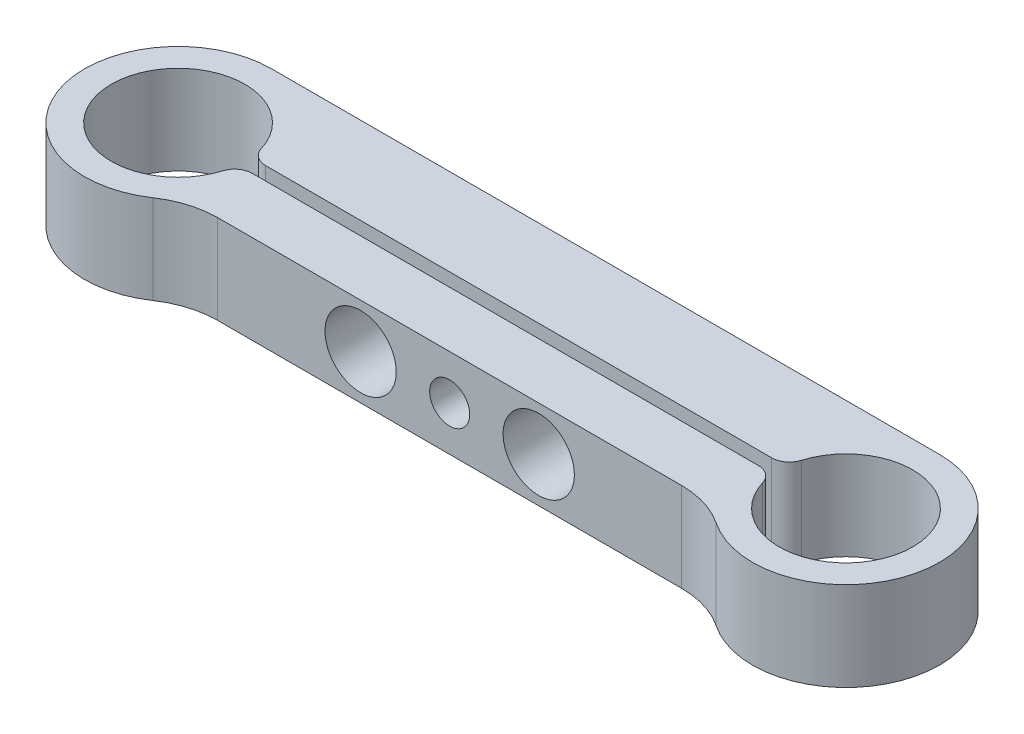
ISO-10303-21;
HEADER;
FILE_DESCRIPTION(('STEP AP214'),'2;1');
FILE_NAME('part.step','',(''),(''),'','','');
FILE_SCHEMA(('AUTOMOTIVE_DESIGN { 1 0 10303 214 1 1 1 1 }'));
ENDSEC;
DATA;
#1=APPLICATION_CONTEXT('core data for automotive mechanical design processes');
#2=APPLICATION_PROTOCOL_DEFINITION('international standard','automotive_design',2000,#1);
#3=PRODUCT_CONTEXT('',#1,'mechanical');
#4=PRODUCT('Part','Part','',(#3));
#5=PRODUCT_RELATED_PRODUCT_CATEGORY('part','',(#4));
#6=PRODUCT_DEFINITION_FORMATION('','',#4);
#7=PRODUCT_DEFINITION_CONTEXT('part definition',#1,'design');
#8=PRODUCT_DEFINITION('design','',#6,#7);
#9=PRODUCT_DEFINITION_SHAPE('','',#8);
#10=(LENGTH_UNIT() NAMED_UNIT(*) SI_UNIT(.MILLI.,.METRE.));
#11=(NAMED_UNIT(*) PLANE_ANGLE_UNIT() SI_UNIT($,.RADIAN.));
#12=(NAMED_UNIT(*) SI_UNIT($,.STERADIAN.) SOLID_ANGLE_UNIT());
#13=UNCERTAINTY_MEASURE_WITH_UNIT(LENGTH_MEASURE(1.E-05),#10,'distance_accuracy_value','');
#14=(GEOMETRIC_REPRESENTATION_CONTEXT(3) GLOBAL_UNCERTAINTY_ASSIGNED_CONTEXT((#13)) GLOBAL_UNIT_ASSIGNED_CONTEXT((#10,
#11,#12)) REPRESENTATION_CONTEXT('',''));
#15=CARTESIAN_POINT('',(0.,0.,0.));
#16=DIRECTION('',(0.,0.,1.));
#17=DIRECTION('',(1.,0.,0.));
#18=AXIS2_PLACEMENT_3D('',#15,#16,#17);
#19=CARTESIAN_POINT('',(75.,10.,0.));
#20=DIRECTION('',(0.,1.,0.));
#21=DIRECTION('',(0.,0.,1.));
#22=AXIS2_PLACEMENT_3D('',#19,#20,#21);
#23=PLANE('',#22);
#24=DIRECTION('',(1.,0.,0.));
#25=VECTOR('',#24,1.);
#26=CARTESIAN_POINT('',(67.1737620787507,10.,7.));
#27=LINE('',#26,#25);
#28=CARTESIAN_POINT('',(11.4564392373896,10.,7.00000000000001));
#29=VERTEX_POINT('',#28);
#30=CARTESIAN_POINT('',(63.5435607626104,10.,7.));
#31=VERTEX_POINT('',#30);
#32=EDGE_CURVE('E169',#29,#31,#27,.T.);
#33=ORIENTED_EDGE('',*,*,#32,.T.);
#34=CARTESIAN_POINT('',(63.5435607626104,10.,17.));
#35=DIRECTION('',(0.,1.,0.));
#36=DIRECTION('',(0.,0.,1.));
#37=AXIS2_PLACEMENT_3D('',#34,#35,#36);
#38=CIRCLE('',#37,10.);
#39=CARTESIAN_POINT('',(69.1320677076785,10.,8.70731707317074));
#40=VERTEX_POINT('',#39);
#41=EDGE_CURVE('E145',#31,#40,#38,.F.);
#42=ORIENTED_EDGE('',*,*,#41,.T.);
#43=CARTESIAN_POINT('',(75.,10.,0.));
#44=DIRECTION('',(0.,1.,0.));
#45=DIRECTION('',(0.,0.,1.));
#46=AXIS2_PLACEMENT_3D('',#43,#44,#45);
#47=CIRCLE('',#46,10.5);
#48=CARTESIAN_POINT('',(75.,10.,-10.5));
#49=VERTEX_POINT('',#48);
#50=EDGE_CURVE('E138',#40,#49,#47,.T.);
#51=ORIENTED_EDGE('',*,*,#50,.T.);
#52=DIRECTION('',(-1.,0.,0.));
#53=VECTOR('',#52,1.);
#54=CARTESIAN_POINT('',(0.,10.,-10.5));
#55=LINE('',#54,#53);
#56=CARTESIAN_POINT('',(0.,10.,-10.5));
#57=VERTEX_POINT('',#56);
#58=EDGE_CURVE('E142',#49,#57,#55,.T.);
#59=ORIENTED_EDGE('',*,*,#58,.T.);
#60=CARTESIAN_POINT('',(0.,10.,0.));
#61=DIRECTION('',(0.,1.,0.));
#62=DIRECTION('',(0.,0.,1.));
#63=AXIS2_PLACEMENT_3D('',#60,#61,#62);
#64=CIRCLE('',#63,10.5);
#65=CARTESIAN_POINT('',(5.86793229232149,10.,8.70731707317074));
#66=VERTEX_POINT('',#65);
#67=EDGE_CURVE('E159',#57,#66,#64,.T.);
#68=ORIENTED_EDGE('',*,*,#67,.T.);
#69=CARTESIAN_POINT('',(11.4564392373896,10.,17.));
#70=DIRECTION('',(0.,1.,0.));
#71=DIRECTION('',(0.,0.,1.));
#72=AXIS2_PLACEMENT_3D('',#69,#70,#71);
#73=CIRCLE('',#72,10.);
#74=EDGE_CURVE('E181',#66,#29,#73,.F.);
#75=ORIENTED_EDGE('',*,*,#74,.T.);
#76=EDGE_LOOP('',(#33,#42,#51,#59,#68,#75));
#77=FACE_BOUND('',#76,.T.);
#78=DIRECTION('',(-1.,0.,0.));
#79=VECTOR('',#78,1.);
#80=CARTESIAN_POINT('',(7.46240577829965,10.,-0.75));
#81=LINE('',#80,#79);
#82=CARTESIAN_POINT('',(65.9067332602634,10.,-0.75));
#83=VERTEX_POINT('',#82);
#84=CARTESIAN_POINT('',(9.09326673973661,10.,-0.75));
#85=VERTEX_POINT('',#84);
#86=EDGE_CURVE('E247',#83,#85,#81,.T.);
#87=ORIENTED_EDGE('',*,*,#86,.F.);
#88=CARTESIAN_POINT('',(65.9067332602634,10.,-2.75));
#89=DIRECTION('',(0.,1.,0.));
#90=DIRECTION('',(0.,0.,1.));
#91=AXIS2_PLACEMENT_3D('',#88,#89,#90);
#92=CIRCLE('',#91,2.);
#93=CARTESIAN_POINT('',(67.8211052054711,10.,-2.17105263157895));
#94=VERTEX_POINT('',#93);
#95=EDGE_CURVE('E209',#83,#94,#92,.T.);
#96=ORIENTED_EDGE('',*,*,#95,.T.);
#97=CARTESIAN_POINT('',(75.,10.,0.));
#98=DIRECTION('',(0.,1.,0.));
#99=DIRECTION('',(0.,0.,1.));
#100=AXIS2_PLACEMENT_3D('',#97,#98,#99);
#101=CIRCLE('',#100,7.5);
#102=CARTESIAN_POINT('',(67.8211052054711,10.,2.17105263157895));
#103=VERTEX_POINT('',#102);
#104=EDGE_CURVE('E456',#103,#94,#101,.T.);
#105=ORIENTED_EDGE('',*,*,#104,.F.);
#106=CARTESIAN_POINT('',(65.9067332602634,10.,2.75));
#107=DIRECTION('',(0.,1.,0.));
#108=DIRECTION('',(0.,0.,1.));
#109=AXIS2_PLACEMENT_3D('',#106,#107,#108);
#110=CIRCLE('',#109,2.);
#111=CARTESIAN_POINT('',(65.9067332602634,10.,0.75));
#112=VERTEX_POINT('',#111);
#113=EDGE_CURVE('E207',#103,#112,#110,.T.);
#114=ORIENTED_EDGE('',*,*,#113,.T.);
#115=DIRECTION('',(1.,0.,0.));
#116=VECTOR('',#115,1.);
#117=CARTESIAN_POINT('',(7.46240577829965,10.,0.75));
#118=LINE('',#117,#116);
#119=CARTESIAN_POINT('',(9.09326673973661,10.,0.75));
#120=VERTEX_POINT('',#119);
#121=EDGE_CURVE('E223',#120,#112,#118,.T.);
#122=ORIENTED_EDGE('',*,*,#121,.F.);
#123=CARTESIAN_POINT('',(9.09326673973661,10.,2.75));
#124=DIRECTION('',(0.,1.,0.));
#125=DIRECTION('',(0.,0.,1.));
#126=AXIS2_PLACEMENT_3D('',#123,#124,#125);
#127=CIRCLE('',#126,2.);
#128=CARTESIAN_POINT('',(7.1788947945289,10.,2.17105263157895));
#129=VERTEX_POINT('',#128);
#130=EDGE_CURVE('E52',#120,#129,#127,.T.);
#131=ORIENTED_EDGE('',*,*,#130,.T.);
#132=CARTESIAN_POINT('',(0.,10.,0.));
#133=DIRECTION('',(0.,1.,0.));
#134=DIRECTION('',(0.,0.,1.));
#135=AXIS2_PLACEMENT_3D('',#132,#133,#134);
#136=CIRCLE('',#135,7.5);
#137=CARTESIAN_POINT('',(7.1788947945289,10.,-2.17105263157895));
#138=VERTEX_POINT('',#137);
#139=EDGE_CURVE('E241',#138,#129,#136,.T.);
#140=ORIENTED_EDGE('',*,*,#139,.F.);
#141=CARTESIAN_POINT('',(9.09326673973661,10.,-2.75));
#142=DIRECTION('',(0.,1.,0.));
#143=DIRECTION('',(0.,0.,1.));
#144=AXIS2_PLACEMENT_3D('',#141,#142,#143);
#145=CIRCLE('',#144,2.);
#146=EDGE_CURVE('E204',#138,#85,#145,.T.);
#147=ORIENTED_EDGE('',*,*,#146,.T.);
#148=EDGE_LOOP('',(#87,#96,#105,#114,#122,#131,#140,#147));
#149=FACE_BOUND('',#148,.T.);
#150=ADVANCED_FACE('F37',(#77,#149),#23,.T.);
#151=CARTESIAN_POINT('',(75.,0.,0.));
#152=DIRECTION('',(0.,1.,0.));
#153=DIRECTION('',(0.,0.,1.));
#154=AXIS2_PLACEMENT_3D('',#151,#152,#153);
#155=PLANE('',#154);
#156=CARTESIAN_POINT('',(75.,0.,0.));
#157=DIRECTION('',(0.,1.,0.));
#158=DIRECTION('',(0.,0.,1.));
#159=AXIS2_PLACEMENT_3D('',#156,#157,#158);
#160=CIRCLE('',#159,10.5);
#161=CARTESIAN_POINT('',(69.1320677076785,0.,8.70731707317074));
#162=VERTEX_POINT('',#161);
#163=CARTESIAN_POINT('',(75.,0.,-10.5));
#164=VERTEX_POINT('',#163);
#165=EDGE_CURVE('E163',#162,#164,#160,.T.);
#166=ORIENTED_EDGE('',*,*,#165,.F.);
#167=CARTESIAN_POINT('',(63.5435607626104,0.,17.));
#168=DIRECTION('',(0.,1.,0.));
#169=DIRECTION('',(0.,0.,1.));
#170=AXIS2_PLACEMENT_3D('',#167,#168,#169);
#171=CIRCLE('',#170,10.);
#172=CARTESIAN_POINT('',(63.5435607626104,0.,7.));
#173=VERTEX_POINT('',#172);
#174=EDGE_CURVE('E183',#162,#173,#171,.T.);
#175=ORIENTED_EDGE('',*,*,#174,.T.);
#176=DIRECTION('',(1.,0.,0.));
#177=VECTOR('',#176,1.);
#178=CARTESIAN_POINT('',(67.1737620787507,0.,7.));
#179=LINE('',#178,#177);
#180=CARTESIAN_POINT('',(11.4564392373896,0.,7.00000000000001));
#181=VERTEX_POINT('',#180);
#182=EDGE_CURVE('E150',#181,#173,#179,.T.);
#183=ORIENTED_EDGE('',*,*,#182,.F.);
#184=CARTESIAN_POINT('',(11.4564392373896,0.,17.));
#185=DIRECTION('',(0.,1.,0.));
#186=DIRECTION('',(0.,0.,1.));
#187=AXIS2_PLACEMENT_3D('',#184,#185,#186);
#188=CIRCLE('',#187,10.);
#189=CARTESIAN_POINT('',(5.86793229232149,0.,8.70731707317074));
#190=VERTEX_POINT('',#189);
#191=EDGE_CURVE('E179',#181,#190,#188,.T.);
#192=ORIENTED_EDGE('',*,*,#191,.T.);
#193=CARTESIAN_POINT('',(0.,0.,0.));
#194=DIRECTION('',(0.,1.,0.));
#195=DIRECTION('',(0.,0.,1.));
#196=AXIS2_PLACEMENT_3D('',#193,#194,#195);
#197=CIRCLE('',#196,10.5);
#198=CARTESIAN_POINT('',(0.,0.,-10.5));
#199=VERTEX_POINT('',#198);
#200=EDGE_CURVE('E249',#199,#190,#197,.T.);
#201=ORIENTED_EDGE('',*,*,#200,.F.);
#202=DIRECTION('',(-1.,0.,0.));
#203=VECTOR('',#202,1.);
#204=CARTESIAN_POINT('',(0.,0.,-10.5));
#205=LINE('',#204,#203);
#206=EDGE_CURVE('E246',#164,#199,#205,.T.);
#207=ORIENTED_EDGE('',*,*,#206,.F.);
#208=EDGE_LOOP('',(#166,#175,#183,#192,#201,#207));
#209=FACE_BOUND('',#208,.T.);
#210=CARTESIAN_POINT('',(75.,0.,0.));
#211=DIRECTION('',(0.,1.,0.));
#212=DIRECTION('',(0.,0.,1.));
#213=AXIS2_PLACEMENT_3D('',#210,#211,#212);
#214=CIRCLE('',#213,7.5);
#215=CARTESIAN_POINT('',(67.8211052054711,0.,2.17105263157895));
#216=VERTEX_POINT('',#215);
#217=CARTESIAN_POINT('',(67.8211052054711,0.,-2.17105263157895));
#218=VERTEX_POINT('',#217);
#219=EDGE_CURVE('E231',#216,#218,#214,.T.);
#220=ORIENTED_EDGE('',*,*,#219,.T.);
#221=CARTESIAN_POINT('',(65.9067332602634,0.,-2.75));
#222=DIRECTION('',(0.,1.,0.));
#223=DIRECTION('',(0.,0.,1.));
#224=AXIS2_PLACEMENT_3D('',#221,#222,#223);
#225=CIRCLE('',#224,2.);
#226=CARTESIAN_POINT('',(65.9067332602634,0.,-0.75));
#227=VERTEX_POINT('',#226);
#228=EDGE_CURVE('E197',#218,#227,#225,.F.);
#229=ORIENTED_EDGE('',*,*,#228,.T.);
#230=DIRECTION('',(-1.,0.,0.));
#231=VECTOR('',#230,1.);
#232=CARTESIAN_POINT('',(7.46240577829965,0.,-0.75));
#233=LINE('',#232,#231);
#234=CARTESIAN_POINT('',(9.09326673973661,0.,-0.75));
#235=VERTEX_POINT('',#234);
#236=EDGE_CURVE('E234',#227,#235,#233,.T.);
#237=ORIENTED_EDGE('',*,*,#236,.T.);
#238=CARTESIAN_POINT('',(9.09326673973661,0.,-2.75));
#239=DIRECTION('',(0.,1.,0.));
#240=DIRECTION('',(0.,0.,1.));
#241=AXIS2_PLACEMENT_3D('',#238,#239,#240);
#242=CIRCLE('',#241,2.);
#243=CARTESIAN_POINT('',(7.1788947945289,0.,-2.17105263157895));
#244=VERTEX_POINT('',#243);
#245=EDGE_CURVE('E191',#235,#244,#242,.F.);
#246=ORIENTED_EDGE('',*,*,#245,.T.);
#247=CARTESIAN_POINT('',(0.,0.,0.));
#248=DIRECTION('',(0.,1.,0.));
#249=DIRECTION('',(0.,0.,1.));
#250=AXIS2_PLACEMENT_3D('',#247,#248,#249);
#251=CIRCLE('',#250,7.5);
#252=CARTESIAN_POINT('',(7.1788947945289,0.,2.17105263157895));
#253=VERTEX_POINT('',#252);
#254=EDGE_CURVE('E232',#244,#253,#251,.T.);
#255=ORIENTED_EDGE('',*,*,#254,.T.);
#256=CARTESIAN_POINT('',(9.09326673973661,0.,2.75));
#257=DIRECTION('',(0.,1.,0.));
#258=DIRECTION('',(0.,0.,1.));
#259=AXIS2_PLACEMENT_3D('',#256,#257,#258);
#260=CIRCLE('',#259,2.);
#261=CARTESIAN_POINT('',(9.09326673973661,0.,0.75));
#262=VERTEX_POINT('',#261);
#263=EDGE_CURVE('E193',#253,#262,#260,.F.);
#264=ORIENTED_EDGE('',*,*,#263,.T.);
#265=DIRECTION('',(1.,0.,0.));
#266=VECTOR('',#265,1.);
#267=CARTESIAN_POINT('',(7.46240577829965,0.,0.75));
#268=LINE('',#267,#266);
#269=CARTESIAN_POINT('',(65.9067332602634,0.,0.75));
#270=VERTEX_POINT('',#269);
#271=EDGE_CURVE('E221',#262,#270,#268,.T.);
#272=ORIENTED_EDGE('',*,*,#271,.T.);
#273=CARTESIAN_POINT('',(65.9067332602634,0.,2.75));
#274=DIRECTION('',(0.,1.,0.));
#275=DIRECTION('',(0.,0.,1.));
#276=AXIS2_PLACEMENT_3D('',#273,#274,#275);
#277=CIRCLE('',#276,2.);
#278=EDGE_CURVE('E195',#270,#216,#277,.F.);
#279=ORIENTED_EDGE('',*,*,#278,.T.);
#280=EDGE_LOOP('',(#220,#229,#237,#246,#255,#264,#272,#279));
#281=FACE_BOUND('',#280,.T.);
#282=ADVANCED_FACE('F228',(#209,#281),#155,.F.);
#283=CARTESIAN_POINT('',(75.,10.,0.));
#284=DIRECTION('',(0.,-1.,0.));
#285=DIRECTION('',(0.,0.,-1.));
#286=AXIS2_PLACEMENT_3D('',#283,#284,#285);
#287=CYLINDRICAL_SURFACE('',#286,10.5);
#288=ORIENTED_EDGE('',*,*,#50,.F.);
#289=DIRECTION('',(0.,-1.,0.));
#290=VECTOR('',#289,1.);
#291=CARTESIAN_POINT('',(69.1320677076785,10.,8.70731707317074));
#292=LINE('',#291,#290);
#293=EDGE_CURVE('E177',#40,#162,#292,.T.);
#294=ORIENTED_EDGE('',*,*,#293,.T.);
#295=ORIENTED_EDGE('',*,*,#165,.T.);
#296=DIRECTION('',(0.,-1.,0.));
#297=VECTOR('',#296,1.);
#298=CARTESIAN_POINT('',(75.,10.,-10.5));
#299=LINE('',#298,#297);
#300=EDGE_CURVE('E155',#49,#164,#299,.T.);
#301=ORIENTED_EDGE('',*,*,#300,.F.);
#302=EDGE_LOOP('',(#288,#294,#295,#301));
#303=FACE_BOUND('',#302,.T.);
#304=ADVANCED_FACE('F161',(#303),#287,.T.);
#305=CARTESIAN_POINT('',(0.,10.,-10.5));
#306=DIRECTION('',(0.,0.,1.));
#307=DIRECTION('',(1.,0.,0.));
#308=AXIS2_PLACEMENT_3D('',#305,#306,#307);
#309=PLANE('',#308);
#310=CARTESIAN_POINT('',(37.5,5.,-10.5));
#311=DIRECTION('',(0.,0.,1.));
#312=DIRECTION('',(1.,0.,0.));
#313=AXIS2_PLACEMENT_3D('',#310,#311,#312);
#314=CIRCLE('',#313,1.65);
#315=CARTESIAN_POINT('',(39.15,5.,-10.5));
#316=VERTEX_POINT('',#315);
#317=EDGE_CURVE('E491',#316,#316,#314,.T.);
#318=ORIENTED_EDGE('',*,*,#317,.T.);
#319=EDGE_LOOP('',(#318));
#320=FACE_BOUND('',#319,.T.);
#321=CARTESIAN_POINT('',(47.5,5.,-10.5));
#322=DIRECTION('',(0.,0.,1.));
#323=DIRECTION('',(1.,0.,0.));
#324=AXIS2_PLACEMENT_3D('',#321,#322,#323);
#325=CIRCLE('',#324,2.24999999999999);
#326=CARTESIAN_POINT('',(49.75,5.,-10.5));
#327=VERTEX_POINT('',#326);
#328=EDGE_CURVE('E479',#327,#327,#325,.T.);
#329=ORIENTED_EDGE('',*,*,#328,.T.);
#330=EDGE_LOOP('',(#329));
#331=FACE_BOUND('',#330,.T.);
#332=CARTESIAN_POINT('',(27.5,5.,-10.5));
#333=DIRECTION('',(0.,0.,1.));
#334=DIRECTION('',(1.,0.,0.));
#335=AXIS2_PLACEMENT_3D('',#332,#333,#334);
#336=CIRCLE('',#335,2.24999999999999);
#337=CARTESIAN_POINT('',(29.75,5.,-10.5));
#338=VERTEX_POINT('',#337);
#339=EDGE_CURVE('E473',#338,#338,#336,.T.);
#340=ORIENTED_EDGE('',*,*,#339,.T.);
#341=EDGE_LOOP('',(#340));
#342=FACE_BOUND('',#341,.T.);
#343=ORIENTED_EDGE('',*,*,#206,.T.);
#344=DIRECTION('',(0.,-1.,0.));
#345=VECTOR('',#344,1.);
#346=CARTESIAN_POINT('',(0.,10.,-10.5));
#347=LINE('',#346,#345);
#348=EDGE_CURVE('E157',#57,#199,#347,.T.);
#349=ORIENTED_EDGE('',*,*,#348,.F.);
#350=ORIENTED_EDGE('',*,*,#58,.F.);
#351=ORIENTED_EDGE('',*,*,#300,.T.);
#352=EDGE_LOOP('',(#343,#349,#350,#351));
#353=FACE_BOUND('',#352,.T.);
#354=ADVANCED_FACE('F154',(#320,#331,#342,#353),#309,.F.);
#355=CARTESIAN_POINT('',(0.,10.,0.));
#356=DIRECTION('',(0.,-1.,0.));
#357=DIRECTION('',(0.,0.,-1.));
#358=AXIS2_PLACEMENT_3D('',#355,#356,#357);
#359=CYLINDRICAL_SURFACE('',#358,10.5);
#360=ORIENTED_EDGE('',*,*,#200,.T.);
#361=DIRECTION('',(0.,-1.,0.));
#362=VECTOR('',#361,1.);
#363=CARTESIAN_POINT('',(5.86793229232149,10.,8.70731707317074));
#364=LINE('',#363,#362);
#365=EDGE_CURVE('E175',#190,#66,#364,.F.);
#366=ORIENTED_EDGE('',*,*,#365,.T.);
#367=ORIENTED_EDGE('',*,*,#67,.F.);
#368=ORIENTED_EDGE('',*,*,#348,.T.);
#369=EDGE_LOOP('',(#360,#366,#367,#368));
#370=FACE_BOUND('',#369,.T.);
#371=ADVANCED_FACE('F263',(#370),#359,.T.);
#372=CARTESIAN_POINT('',(67.1737620787507,10.,7.));
#373=DIRECTION('',(0.,0.,-1.));
#374=DIRECTION('',(-1.,0.,0.));
#375=AXIS2_PLACEMENT_3D('',#372,#373,#374);
#376=PLANE('',#375);
#377=CARTESIAN_POINT('',(37.5,5.,7.00000000000001));
#378=DIRECTION('',(0.,0.,1.));
#379=DIRECTION('',(1.,0.,0.));
#380=AXIS2_PLACEMENT_3D('',#377,#378,#379);
#381=CIRCLE('',#380,2.24999999999999);
#382=CARTESIAN_POINT('',(39.75,5.,7.00000000000001));
#383=VERTEX_POINT('',#382);
#384=EDGE_CURVE('E488',#383,#383,#381,.T.);
#385=ORIENTED_EDGE('',*,*,#384,.F.);
#386=EDGE_LOOP('',(#385));
#387=FACE_BOUND('',#386,.T.);
#388=CARTESIAN_POINT('',(27.5,5.,7.00000000000001));
#389=DIRECTION('',(0.,0.,1.));
#390=DIRECTION('',(1.,0.,0.));
#391=AXIS2_PLACEMENT_3D('',#388,#389,#390);
#392=CIRCLE('',#391,3.99999999999999);
#393=CARTESIAN_POINT('',(31.5,5.,7.00000000000001));
#394=VERTEX_POINT('',#393);
#395=EDGE_CURVE('E470',#394,#394,#392,.T.);
#396=ORIENTED_EDGE('',*,*,#395,.F.);
#397=EDGE_LOOP('',(#396));
#398=FACE_BOUND('',#397,.T.);
#399=CARTESIAN_POINT('',(47.5,5.,7.00000000000001));
#400=DIRECTION('',(0.,0.,1.));
#401=DIRECTION('',(1.,0.,0.));
#402=AXIS2_PLACEMENT_3D('',#399,#400,#401);
#403=CIRCLE('',#402,3.99999999999999);
#404=CARTESIAN_POINT('',(51.5,5.,7.00000000000001));
#405=VERTEX_POINT('',#404);
#406=EDGE_CURVE('E464',#405,#405,#403,.T.);
#407=ORIENTED_EDGE('',*,*,#406,.F.);
#408=EDGE_LOOP('',(#407));
#409=FACE_BOUND('',#408,.T.);
#410=ORIENTED_EDGE('',*,*,#32,.F.);
#411=DIRECTION('',(0.,1.,0.));
#412=VECTOR('',#411,1.);
#413=CARTESIAN_POINT('',(11.4564392373896,0.,7.00000000000001));
#414=LINE('',#413,#412);
#415=EDGE_CURVE('E167',#29,#181,#414,.F.);
#416=ORIENTED_EDGE('',*,*,#415,.T.);
#417=ORIENTED_EDGE('',*,*,#182,.T.);
#418=DIRECTION('',(0.,1.,0.));
#419=VECTOR('',#418,1.);
#420=CARTESIAN_POINT('',(63.5435607626104,10.,7.));
#421=LINE('',#420,#419);
#422=EDGE_CURVE('E165',#173,#31,#421,.T.);
#423=ORIENTED_EDGE('',*,*,#422,.T.);
#424=EDGE_LOOP('',(#410,#416,#417,#423));
#425=FACE_BOUND('',#424,.T.);
#426=ADVANCED_FACE('F256',(#387,#398,#409,#425),#376,.F.);
#427=CARTESIAN_POINT('',(0.,10.,0.));
#428=DIRECTION('',(0.,-1.,0.));
#429=DIRECTION('',(0.,0.,-1.));
#430=AXIS2_PLACEMENT_3D('',#427,#428,#429);
#431=CYLINDRICAL_SURFACE('',#430,7.5);
#432=ORIENTED_EDGE('',*,*,#139,.T.);
#433=DIRECTION('',(0.,-1.,0.));
#434=VECTOR('',#433,1.);
#435=CARTESIAN_POINT('',(7.1788947945289,10.,2.17105263157895));
#436=LINE('',#435,#434);
#437=EDGE_CURVE('E11',#129,#253,#436,.T.);
#438=ORIENTED_EDGE('',*,*,#437,.T.);
#439=ORIENTED_EDGE('',*,*,#254,.F.);
#440=DIRECTION('',(0.,-1.,0.));
#441=VECTOR('',#440,1.);
#442=CARTESIAN_POINT('',(7.1788947945289,10.,-2.17105263157895));
#443=LINE('',#442,#441);
#444=EDGE_CURVE('E45',#244,#138,#443,.F.);
#445=ORIENTED_EDGE('',*,*,#444,.T.);
#446=EDGE_LOOP('',(#432,#438,#439,#445));
#447=FACE_BOUND('',#446,.T.);
#448=ADVANCED_FACE('F289',(#447),#431,.F.);
#449=CARTESIAN_POINT('',(7.46240577829965,10.,0.75));
#450=DIRECTION('',(0.,0.,-1.));
#451=DIRECTION('',(-1.,0.,0.));
#452=AXIS2_PLACEMENT_3D('',#449,#450,#451);
#453=PLANE('',#452);
#454=CARTESIAN_POINT('',(37.5,5.,0.75));
#455=DIRECTION('',(0.,0.,-1.));
#456=DIRECTION('',(-1.,0.,0.));
#457=AXIS2_PLACEMENT_3D('',#454,#455,#456);
#458=CIRCLE('',#457,2.25);
#459=CARTESIAN_POINT('',(35.25,5.,0.75));
#460=VERTEX_POINT('',#459);
#461=EDGE_CURVE('E485',#460,#460,#458,.T.);
#462=ORIENTED_EDGE('',*,*,#461,.F.);
#463=EDGE_LOOP('',(#462));
#464=FACE_BOUND('',#463,.T.);
#465=CARTESIAN_POINT('',(27.5,5.,0.75));
#466=DIRECTION('',(0.,0.,-1.));
#467=DIRECTION('',(-1.,0.,0.));
#468=AXIS2_PLACEMENT_3D('',#465,#466,#467);
#469=CIRCLE('',#468,3.99999999999999);
#470=CARTESIAN_POINT('',(23.5,5.,0.75));
#471=VERTEX_POINT('',#470);
#472=EDGE_CURVE('E467',#471,#471,#469,.T.);
#473=ORIENTED_EDGE('',*,*,#472,.F.);
#474=EDGE_LOOP('',(#473));
#475=FACE_BOUND('',#474,.T.);
#476=CARTESIAN_POINT('',(47.5,5.,0.75));
#477=DIRECTION('',(0.,0.,-1.));
#478=DIRECTION('',(-1.,0.,0.));
#479=AXIS2_PLACEMENT_3D('',#476,#477,#478);
#480=CIRCLE('',#479,3.99999999999999);
#481=CARTESIAN_POINT('',(43.5,5.,0.75));
#482=VERTEX_POINT('',#481);
#483=EDGE_CURVE('E236',#482,#482,#480,.T.);
#484=ORIENTED_EDGE('',*,*,#483,.F.);
#485=EDGE_LOOP('',(#484));
#486=FACE_BOUND('',#485,.T.);
#487=ORIENTED_EDGE('',*,*,#121,.T.);
#488=DIRECTION('',(0.,-1.,0.));
#489=VECTOR('',#488,1.);
#490=CARTESIAN_POINT('',(65.9067332602634,10.,0.75));
#491=LINE('',#490,#489);
#492=EDGE_CURVE('E213',#112,#270,#491,.T.);
#493=ORIENTED_EDGE('',*,*,#492,.T.);
#494=ORIENTED_EDGE('',*,*,#271,.F.);
#495=DIRECTION('',(0.,-1.,0.));
#496=VECTOR('',#495,1.);
#497=CARTESIAN_POINT('',(9.09326673973661,10.,0.75));
#498=LINE('',#497,#496);
#499=EDGE_CURVE('E211',#262,#120,#498,.F.);
#500=ORIENTED_EDGE('',*,*,#499,.T.);
#501=EDGE_LOOP('',(#487,#493,#494,#500));
#502=FACE_BOUND('',#501,.T.);
#503=ADVANCED_FACE('F220',(#464,#475,#486,#502),#453,.T.);
#504=CARTESIAN_POINT('',(75.,10.,0.));
#505=DIRECTION('',(0.,-1.,0.));
#506=DIRECTION('',(0.,0.,-1.));
#507=AXIS2_PLACEMENT_3D('',#504,#505,#506);
#508=CYLINDRICAL_SURFACE('',#507,7.5);
#509=ORIENTED_EDGE('',*,*,#104,.T.);
#510=DIRECTION('',(0.,-1.,0.));
#511=VECTOR('',#510,1.);
#512=CARTESIAN_POINT('',(67.8211052054711,10.,-2.17105263157895));
#513=LINE('',#512,#511);
#514=EDGE_CURVE('E188',#94,#218,#513,.T.);
#515=ORIENTED_EDGE('',*,*,#514,.T.);
#516=ORIENTED_EDGE('',*,*,#219,.F.);
#517=DIRECTION('',(0.,-1.,0.));
#518=VECTOR('',#517,1.);
#519=CARTESIAN_POINT('',(67.8211052054711,10.,2.17105263157895));
#520=LINE('',#519,#518);
#521=EDGE_CURVE('E186',#216,#103,#520,.F.);
#522=ORIENTED_EDGE('',*,*,#521,.T.);
#523=EDGE_LOOP('',(#509,#515,#516,#522));
#524=FACE_BOUND('',#523,.T.);
#525=ADVANCED_FACE('F333',(#524),#508,.F.);
#526=CARTESIAN_POINT('',(7.46240577829965,10.,-0.75));
#527=DIRECTION('',(0.,0.,1.));
#528=DIRECTION('',(1.,0.,0.));
#529=AXIS2_PLACEMENT_3D('',#526,#527,#528);
#530=PLANE('',#529);
#531=CARTESIAN_POINT('',(37.5,5.,-0.749999999999999));
#532=DIRECTION('',(0.,0.,1.));
#533=DIRECTION('',(1.,0.,0.));
#534=AXIS2_PLACEMENT_3D('',#531,#532,#533);
#535=CIRCLE('',#534,1.64999999999998);
#536=CARTESIAN_POINT('',(39.15,5.,-0.749999999999999));
#537=VERTEX_POINT('',#536);
#538=EDGE_CURVE('E494',#537,#537,#535,.T.);
#539=ORIENTED_EDGE('',*,*,#538,.F.);
#540=EDGE_LOOP('',(#539));
#541=FACE_BOUND('',#540,.T.);
#542=CARTESIAN_POINT('',(47.5,5.,-0.749999999999999));
#543=DIRECTION('',(0.,0.,1.));
#544=DIRECTION('',(1.,0.,0.));
#545=AXIS2_PLACEMENT_3D('',#542,#543,#544);
#546=CIRCLE('',#545,2.24999999999999);
#547=CARTESIAN_POINT('',(49.75,5.,-0.749999999999999));
#548=VERTEX_POINT('',#547);
#549=EDGE_CURVE('E482',#548,#548,#546,.T.);
#550=ORIENTED_EDGE('',*,*,#549,.F.);
#551=EDGE_LOOP('',(#550));
#552=FACE_BOUND('',#551,.T.);
#553=CARTESIAN_POINT('',(27.5,5.,-0.749999999999999));
#554=DIRECTION('',(0.,0.,1.));
#555=DIRECTION('',(1.,0.,0.));
#556=AXIS2_PLACEMENT_3D('',#553,#554,#555);
#557=CIRCLE('',#556,2.24999999999999);
#558=CARTESIAN_POINT('',(29.75,5.,-0.749999999999999));
#559=VERTEX_POINT('',#558);
#560=EDGE_CURVE('E476',#559,#559,#557,.T.);
#561=ORIENTED_EDGE('',*,*,#560,.F.);
#562=EDGE_LOOP('',(#561));
#563=FACE_BOUND('',#562,.T.);
#564=ORIENTED_EDGE('',*,*,#236,.F.);
#565=DIRECTION('',(0.,-1.,0.));
#566=VECTOR('',#565,1.);
#567=CARTESIAN_POINT('',(65.9067332602634,10.,-0.75));
#568=LINE('',#567,#566);
#569=EDGE_CURVE('E202',#227,#83,#568,.F.);
#570=ORIENTED_EDGE('',*,*,#569,.T.);
#571=ORIENTED_EDGE('',*,*,#86,.T.);
#572=DIRECTION('',(0.,-1.,0.));
#573=VECTOR('',#572,1.);
#574=CARTESIAN_POINT('',(9.09326673973661,10.,-0.75));
#575=LINE('',#574,#573);
#576=EDGE_CURVE('E199',#85,#235,#575,.T.);
#577=ORIENTED_EDGE('',*,*,#576,.T.);
#578=EDGE_LOOP('',(#564,#570,#571,#577));
#579=FACE_BOUND('',#578,.T.);
#580=ADVANCED_FACE('F342',(#541,#552,#563,#579),#530,.T.);
#581=CARTESIAN_POINT('',(47.5,5.,7.00000000000001));
#582=DIRECTION('',(0.,0.,1.));
#583=DIRECTION('',(1.,0.,0.));
#584=AXIS2_PLACEMENT_3D('',#581,#582,#583);
#585=CYLINDRICAL_SURFACE('',#584,3.99999999999999);
#586=ORIENTED_EDGE('',*,*,#406,.T.);
#587=EDGE_LOOP('',(#586));
#588=FACE_BOUND('',#587,.T.);
#589=ORIENTED_EDGE('',*,*,#483,.T.);
#590=EDGE_LOOP('',(#589));
#591=FACE_BOUND('',#590,.T.);
#592=ADVANCED_FACE('F352',(#588,#591),#585,.F.);
#593=CARTESIAN_POINT('',(27.5,5.,7.00000000000001));
#594=DIRECTION('',(0.,0.,1.));
#595=DIRECTION('',(1.,0.,0.));
#596=AXIS2_PLACEMENT_3D('',#593,#594,#595);
#597=CYLINDRICAL_SURFACE('',#596,3.99999999999999);
#598=ORIENTED_EDGE('',*,*,#395,.T.);
#599=EDGE_LOOP('',(#598));
#600=FACE_BOUND('',#599,.T.);
#601=ORIENTED_EDGE('',*,*,#472,.T.);
#602=EDGE_LOOP('',(#601));
#603=FACE_BOUND('',#602,.T.);
#604=ADVANCED_FACE('F363',(#600,#603),#597,.F.);
#605=CARTESIAN_POINT('',(27.5,5.,-0.75));
#606=DIRECTION('',(0.,0.,1.));
#607=DIRECTION('',(1.,0.,0.));
#608=AXIS2_PLACEMENT_3D('',#605,#606,#607);
#609=CYLINDRICAL_SURFACE('',#608,2.24999999999999);
#610=ORIENTED_EDGE('',*,*,#560,.T.);
#611=EDGE_LOOP('',(#610));
#612=FACE_BOUND('',#611,.T.);
#613=ORIENTED_EDGE('',*,*,#339,.F.);
#614=EDGE_LOOP('',(#613));
#615=FACE_BOUND('',#614,.T.);
#616=ADVANCED_FACE('F370',(#612,#615),#609,.F.);
#617=CARTESIAN_POINT('',(47.5,5.,-0.75));
#618=DIRECTION('',(0.,0.,1.));
#619=DIRECTION('',(1.,0.,0.));
#620=AXIS2_PLACEMENT_3D('',#617,#618,#619);
#621=CYLINDRICAL_SURFACE('',#620,2.24999999999999);
#622=ORIENTED_EDGE('',*,*,#549,.T.);
#623=EDGE_LOOP('',(#622));
#624=FACE_BOUND('',#623,.T.);
#625=ORIENTED_EDGE('',*,*,#328,.F.);
#626=EDGE_LOOP('',(#625));
#627=FACE_BOUND('',#626,.T.);
#628=ADVANCED_FACE('F379',(#624,#627),#621,.F.);
#629=CARTESIAN_POINT('',(37.5,5.,7.00000000000001));
#630=DIRECTION('',(0.,0.,1.));
#631=DIRECTION('',(1.,0.,0.));
#632=AXIS2_PLACEMENT_3D('',#629,#630,#631);
#633=CYLINDRICAL_SURFACE('',#632,2.25);
#634=ORIENTED_EDGE('',*,*,#384,.T.);
#635=EDGE_LOOP('',(#634));
#636=FACE_BOUND('',#635,.T.);
#637=ORIENTED_EDGE('',*,*,#461,.T.);
#638=EDGE_LOOP('',(#637));
#639=FACE_BOUND('',#638,.T.);
#640=ADVANCED_FACE('F277',(#636,#639),#633,.F.);
#641=CARTESIAN_POINT('',(37.5,5.,-0.75));
#642=DIRECTION('',(0.,0.,1.));
#643=DIRECTION('',(1.,0.,0.));
#644=AXIS2_PLACEMENT_3D('',#641,#642,#643);
#645=CYLINDRICAL_SURFACE('',#644,1.64999999999999);
#646=ORIENTED_EDGE('',*,*,#317,.F.);
#647=EDGE_LOOP('',(#646));
#648=FACE_BOUND('',#647,.T.);
#649=ORIENTED_EDGE('',*,*,#538,.T.);
#650=EDGE_LOOP('',(#649));
#651=FACE_BOUND('',#650,.T.);
#652=ADVANCED_FACE('F269',(#648,#651),#645,.F.);
#653=CARTESIAN_POINT('',(11.4564392373896,10.,17.));
#654=DIRECTION('',(0.,-1.,0.));
#655=DIRECTION('',(0.,0.,-1.));
#656=AXIS2_PLACEMENT_3D('',#653,#654,#655);
#657=CYLINDRICAL_SURFACE('',#656,10.);
#658=ORIENTED_EDGE('',*,*,#74,.F.);
#659=ORIENTED_EDGE('',*,*,#365,.F.);
#660=ORIENTED_EDGE('',*,*,#191,.F.);
#661=ORIENTED_EDGE('',*,*,#415,.F.);
#662=EDGE_LOOP('',(#658,#659,#660,#661));
#663=FACE_BOUND('',#662,.T.);
#664=ADVANCED_FACE('F267',(#663),#657,.F.);
#665=CARTESIAN_POINT('',(63.5435607626104,10.,17.));
#666=DIRECTION('',(0.,-1.,0.));
#667=DIRECTION('',(0.,0.,-1.));
#668=AXIS2_PLACEMENT_3D('',#665,#666,#667);
#669=CYLINDRICAL_SURFACE('',#668,10.);
#670=ORIENTED_EDGE('',*,*,#41,.F.);
#671=ORIENTED_EDGE('',*,*,#422,.F.);
#672=ORIENTED_EDGE('',*,*,#174,.F.);
#673=ORIENTED_EDGE('',*,*,#293,.F.);
#674=EDGE_LOOP('',(#670,#671,#672,#673));
#675=FACE_BOUND('',#674,.T.);
#676=ADVANCED_FACE('F260',(#675),#669,.F.);
#677=CARTESIAN_POINT('',(65.9067332602634,10.,-2.75));
#678=DIRECTION('',(0.,-1.,0.));
#679=DIRECTION('',(0.,0.,-1.));
#680=AXIS2_PLACEMENT_3D('',#677,#678,#679);
#681=CYLINDRICAL_SURFACE('',#680,2.);
#682=ORIENTED_EDGE('',*,*,#95,.F.);
#683=ORIENTED_EDGE('',*,*,#569,.F.);
#684=ORIENTED_EDGE('',*,*,#228,.F.);
#685=ORIENTED_EDGE('',*,*,#514,.F.);
#686=EDGE_LOOP('',(#682,#683,#684,#685));
#687=FACE_BOUND('',#686,.T.);
#688=ADVANCED_FACE('F275',(#687),#681,.T.);
#689=CARTESIAN_POINT('',(65.9067332602634,10.,2.75));
#690=DIRECTION('',(0.,-1.,0.));
#691=DIRECTION('',(0.,0.,-1.));
#692=AXIS2_PLACEMENT_3D('',#689,#690,#691);
#693=CYLINDRICAL_SURFACE('',#692,2.);
#694=ORIENTED_EDGE('',*,*,#113,.F.);
#695=ORIENTED_EDGE('',*,*,#521,.F.);
#696=ORIENTED_EDGE('',*,*,#278,.F.);
#697=ORIENTED_EDGE('',*,*,#492,.F.);
#698=EDGE_LOOP('',(#694,#695,#696,#697));
#699=FACE_BOUND('',#698,.T.);
#700=ADVANCED_FACE('F418',(#699),#693,.T.);
#701=CARTESIAN_POINT('',(9.09326673973661,10.,2.75));
#702=DIRECTION('',(0.,-1.,0.));
#703=DIRECTION('',(0.,0.,-1.));
#704=AXIS2_PLACEMENT_3D('',#701,#702,#703);
#705=CYLINDRICAL_SURFACE('',#704,2.);
#706=ORIENTED_EDGE('',*,*,#130,.F.);
#707=ORIENTED_EDGE('',*,*,#499,.F.);
#708=ORIENTED_EDGE('',*,*,#263,.F.);
#709=ORIENTED_EDGE('',*,*,#437,.F.);
#710=EDGE_LOOP('',(#706,#707,#708,#709));
#711=FACE_BOUND('',#710,.T.);
#712=ADVANCED_FACE('F427',(#711),#705,.T.);
#713=CARTESIAN_POINT('',(9.09326673973661,10.,-2.75));
#714=DIRECTION('',(0.,-1.,0.));
#715=DIRECTION('',(0.,0.,-1.));
#716=AXIS2_PLACEMENT_3D('',#713,#714,#715);
#717=CYLINDRICAL_SURFACE('',#716,2.);
#718=ORIENTED_EDGE('',*,*,#146,.F.);
#719=ORIENTED_EDGE('',*,*,#444,.F.);
#720=ORIENTED_EDGE('',*,*,#245,.F.);
#721=ORIENTED_EDGE('',*,*,#576,.F.);
#722=EDGE_LOOP('',(#718,#719,#720,#721));
#723=FACE_BOUND('',#722,.T.);
#724=ADVANCED_FACE('F39',(#723),#717,.T.);
#725=CLOSED_SHELL('',(#150,#282,#304,#354,#371,#426,#448,#503,#525,#580,#592,#604,#616,#628,
#640,#652,#664,#676,#688,#700,#712,#724));
#726=MANIFOLD_SOLID_BREP('B2',#725);
#727=ADVANCED_BREP_SHAPE_REPRESENTATION('',(#18,#726),#14);
#728=SHAPE_DEFINITION_REPRESENTATION(#9,#727);
ENDSEC;
END-ISO-10303-21;
